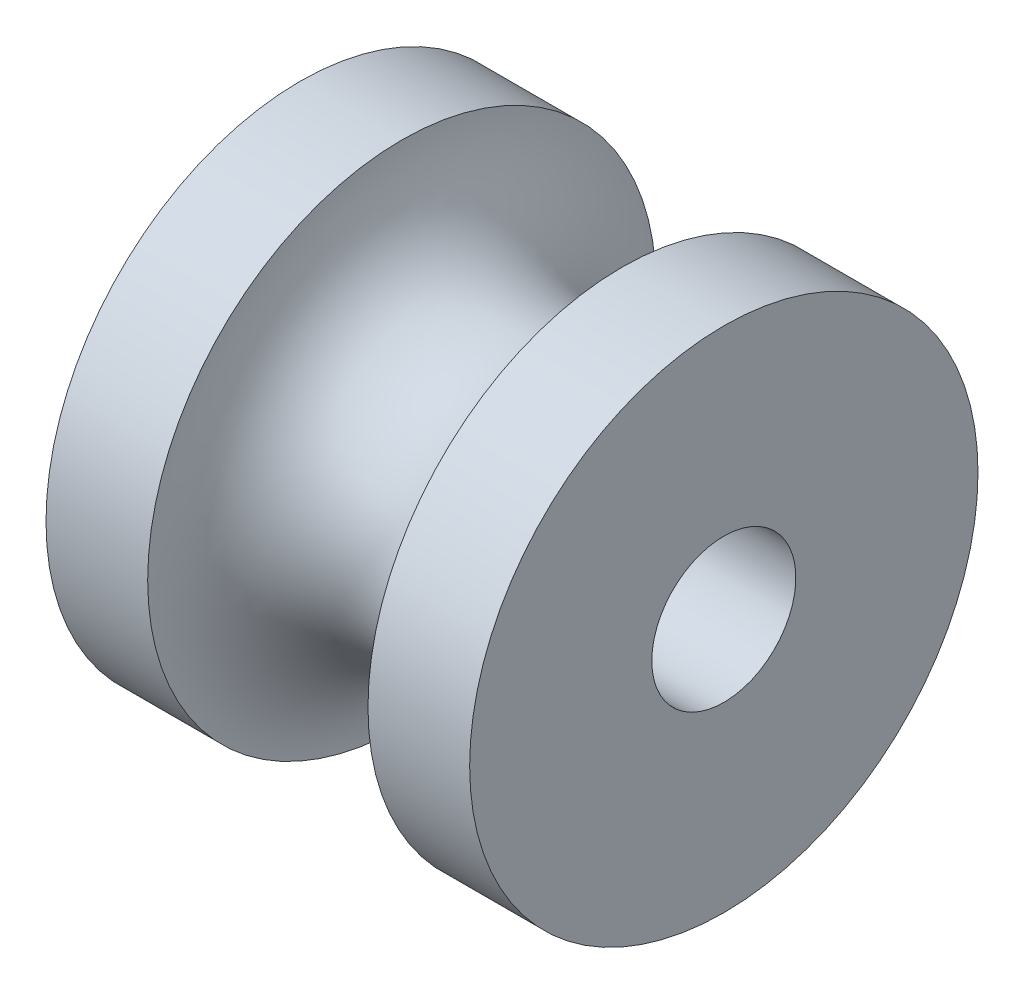
ISO-10303-21;
HEADER;
FILE_DESCRIPTION(('STEP AP214'),'2;1');
FILE_NAME('part.step','',(''),(''),'','','');
FILE_SCHEMA(('AUTOMOTIVE_DESIGN { 1 0 10303 214 1 1 1 1 }'));
ENDSEC;
DATA;
#1=APPLICATION_CONTEXT('core data for automotive mechanical design processes');
#2=APPLICATION_PROTOCOL_DEFINITION('international standard','automotive_design',2000,#1);
#3=PRODUCT_CONTEXT('',#1,'mechanical');
#4=PRODUCT('Part','Part','',(#3));
#5=PRODUCT_RELATED_PRODUCT_CATEGORY('part','',(#4));
#6=PRODUCT_DEFINITION_FORMATION('','',#4);
#7=PRODUCT_DEFINITION_CONTEXT('part definition',#1,'design');
#8=PRODUCT_DEFINITION('design','',#6,#7);
#9=PRODUCT_DEFINITION_SHAPE('','',#8);
#10=(LENGTH_UNIT() NAMED_UNIT(*) SI_UNIT(.MILLI.,.METRE.));
#11=(NAMED_UNIT(*) PLANE_ANGLE_UNIT() SI_UNIT($,.RADIAN.));
#12=(NAMED_UNIT(*) SI_UNIT($,.STERADIAN.) SOLID_ANGLE_UNIT());
#13=UNCERTAINTY_MEASURE_WITH_UNIT(LENGTH_MEASURE(1.E-05),#10,'distance_accuracy_value','');
#14=(GEOMETRIC_REPRESENTATION_CONTEXT(3) GLOBAL_UNCERTAINTY_ASSIGNED_CONTEXT((#13)) GLOBAL_UNIT_ASSIGNED_CONTEXT((#10,
#11,#12)) REPRESENTATION_CONTEXT('',''));
#15=CARTESIAN_POINT('',(0.,0.,0.));
#16=DIRECTION('',(0.,0.,1.));
#17=DIRECTION('',(1.,0.,0.));
#18=AXIS2_PLACEMENT_3D('',#15,#16,#17);
#19=CARTESIAN_POINT('',(-5.,-1.7,0.));
#20=DIRECTION('',(-1.,0.,0.));
#21=DIRECTION('',(0.,0.,1.));
#22=AXIS2_PLACEMENT_3D('',#19,#20,#21);
#23=PLANE('',#22);
#24=CARTESIAN_POINT('',(-5.,0.,0.));
#25=DIRECTION('',(-1.,0.,0.));
#26=DIRECTION('',(0.,0.,1.));
#27=AXIS2_PLACEMENT_3D('',#24,#25,#26);
#28=CIRCLE('',#27,6.);
#29=CARTESIAN_POINT('',(-5.,0.,6.));
#30=VERTEX_POINT('',#29);
#31=EDGE_CURVE('E57',#30,#30,#28,.T.);
#32=ORIENTED_EDGE('',*,*,#31,.T.);
#33=EDGE_LOOP('',(#32));
#34=FACE_BOUND('',#33,.T.);
#35=CARTESIAN_POINT('',(-5.,0.,0.));
#36=DIRECTION('',(-1.,0.,0.));
#37=DIRECTION('',(0.,0.,1.));
#38=AXIS2_PLACEMENT_3D('',#35,#36,#37);
#39=CIRCLE('',#38,1.7);
#40=CARTESIAN_POINT('',(-5.,0.,1.7));
#41=VERTEX_POINT('',#40);
#42=EDGE_CURVE('E10',#41,#41,#39,.T.);
#43=ORIENTED_EDGE('',*,*,#42,.F.);
#44=EDGE_LOOP('',(#43));
#45=FACE_BOUND('',#44,.T.);
#46=ADVANCED_FACE('F35',(#34,#45),#23,.T.);
#47=CARTESIAN_POINT('',(-9.59945258867054,0.,0.));
#48=DIRECTION('',(-1.,0.,0.));
#49=DIRECTION('',(0.,0.,1.));
#50=AXIS2_PLACEMENT_3D('',#47,#48,#49);
#51=CYLINDRICAL_SURFACE('',#50,1.7);
#52=ORIENTED_EDGE('',*,*,#42,.T.);
#53=EDGE_LOOP('',(#52));
#54=FACE_BOUND('',#53,.T.);
#55=CARTESIAN_POINT('',(5.,0.,0.));
#56=DIRECTION('',(-1.,0.,0.));
#57=DIRECTION('',(0.,0.,1.));
#58=AXIS2_PLACEMENT_3D('',#55,#56,#57);
#59=CIRCLE('',#58,1.7);
#60=CARTESIAN_POINT('',(5.,0.,1.7));
#61=VERTEX_POINT('',#60);
#62=EDGE_CURVE('E41',#61,#61,#59,.T.);
#63=ORIENTED_EDGE('',*,*,#62,.F.);
#64=EDGE_LOOP('',(#63));
#65=FACE_BOUND('',#64,.T.);
#66=ADVANCED_FACE('F75',(#54,#65),#51,.F.);
#67=CARTESIAN_POINT('',(5.,-1.7,0.));
#68=DIRECTION('',(1.,0.,0.));
#69=DIRECTION('',(0.,0.,-1.));
#70=AXIS2_PLACEMENT_3D('',#67,#68,#69);
#71=PLANE('',#70);
#72=ORIENTED_EDGE('',*,*,#62,.T.);
#73=EDGE_LOOP('',(#72));
#74=FACE_BOUND('',#73,.T.);
#75=CARTESIAN_POINT('',(5.,0.,0.));
#76=DIRECTION('',(-1.,0.,0.));
#77=DIRECTION('',(0.,0.,1.));
#78=AXIS2_PLACEMENT_3D('',#75,#76,#77);
#79=CIRCLE('',#78,6.);
#80=CARTESIAN_POINT('',(5.,0.,6.));
#81=VERTEX_POINT('',#80);
#82=EDGE_CURVE('E45',#81,#81,#79,.T.);
#83=ORIENTED_EDGE('',*,*,#82,.F.);
#84=EDGE_LOOP('',(#83));
#85=FACE_BOUND('',#84,.T.);
#86=ADVANCED_FACE('F79',(#74,#85),#71,.T.);
#87=CARTESIAN_POINT('',(-9.59945258867054,0.,0.));
#88=DIRECTION('',(-1.,0.,0.));
#89=DIRECTION('',(0.,0.,1.));
#90=AXIS2_PLACEMENT_3D('',#87,#88,#89);
#91=CYLINDRICAL_SURFACE('',#90,6.);
#92=ORIENTED_EDGE('',*,*,#82,.T.);
#93=EDGE_LOOP('',(#92));
#94=FACE_BOUND('',#93,.T.);
#95=CARTESIAN_POINT('',(2.6,0.,0.));
#96=DIRECTION('',(-1.,0.,0.));
#97=DIRECTION('',(0.,0.,1.));
#98=AXIS2_PLACEMENT_3D('',#95,#96,#97);
#99=CIRCLE('',#98,6.00000000000001);
#100=CARTESIAN_POINT('',(2.6,0.,6.00000000000001));
#101=VERTEX_POINT('',#100);
#102=EDGE_CURVE('E49',#101,#101,#99,.T.);
#103=ORIENTED_EDGE('',*,*,#102,.F.);
#104=EDGE_LOOP('',(#103));
#105=FACE_BOUND('',#104,.T.);
#106=ADVANCED_FACE('F71',(#94,#105),#91,.T.);
#107=CARTESIAN_POINT('',(0.,0.,0.));
#108=DIRECTION('',(-1.,0.,0.));
#109=DIRECTION('',(0.,0.,1.));
#110=AXIS2_PLACEMENT_3D('',#107,#108,#109);
#111=TOROIDAL_SURFACE('',#110,6.00000000000001,2.6);
#112=ORIENTED_EDGE('',*,*,#102,.T.);
#113=EDGE_LOOP('',(#112));
#114=FACE_BOUND('',#113,.T.);
#115=CARTESIAN_POINT('',(-2.6,0.,0.));
#116=DIRECTION('',(-1.,0.,0.));
#117=DIRECTION('',(0.,0.,1.));
#118=AXIS2_PLACEMENT_3D('',#115,#116,#117);
#119=CIRCLE('',#118,6.00000000000001);
#120=CARTESIAN_POINT('',(-2.6,0.,6.00000000000001));
#121=VERTEX_POINT('',#120);
#122=EDGE_CURVE('E54',#121,#121,#119,.T.);
#123=ORIENTED_EDGE('',*,*,#122,.F.);
#124=EDGE_LOOP('',(#123));
#125=FACE_BOUND('',#124,.T.);
#126=ADVANCED_FACE('F65',(#114,#125),#111,.F.);
#127=CARTESIAN_POINT('',(-9.59945258867054,0.,0.));
#128=DIRECTION('',(-1.,0.,0.));
#129=DIRECTION('',(0.,0.,1.));
#130=AXIS2_PLACEMENT_3D('',#127,#128,#129);
#131=CYLINDRICAL_SURFACE('',#130,6.);
#132=ORIENTED_EDGE('',*,*,#122,.T.);
#133=EDGE_LOOP('',(#132));
#134=FACE_BOUND('',#133,.T.);
#135=ORIENTED_EDGE('',*,*,#31,.F.);
#136=EDGE_LOOP('',(#135));
#137=FACE_BOUND('',#136,.T.);
#138=ADVANCED_FACE('F63',(#134,#137),#131,.T.);
#139=CLOSED_SHELL('',(#46,#66,#86,#106,#126,#138));
#140=MANIFOLD_SOLID_BREP('B2',#139);
#141=ADVANCED_BREP_SHAPE_REPRESENTATION('',(#18,#140),#14);
#142=SHAPE_DEFINITION_REPRESENTATION(#9,#141);
ENDSEC;
END-ISO-10303-21;
